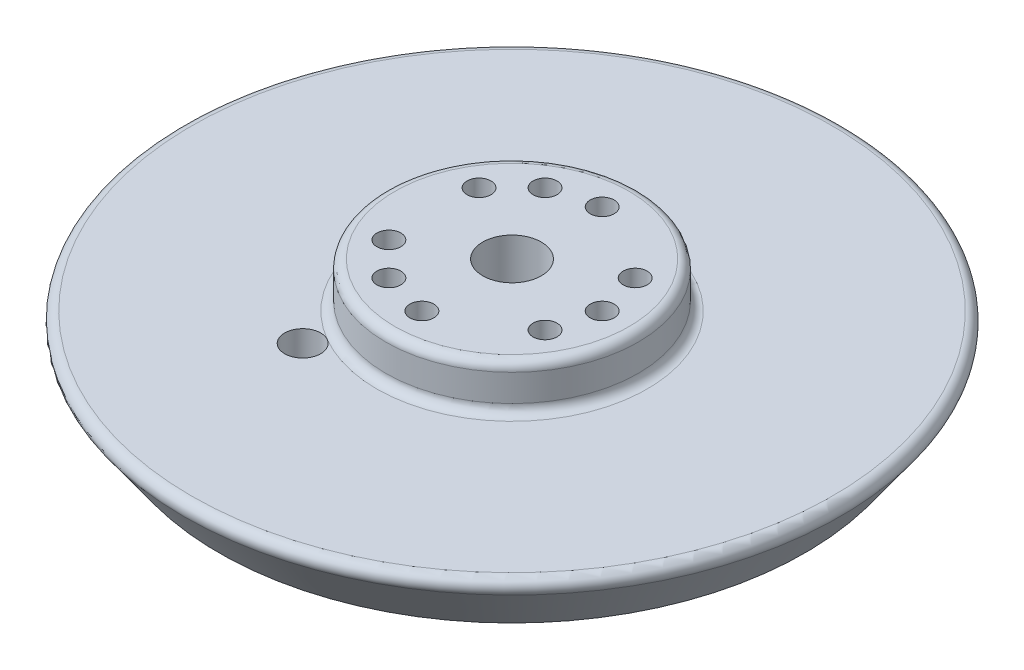
ISO-10303-21;
HEADER;
FILE_DESCRIPTION(('STEP AP214'),'2;1');
FILE_NAME('part.step','',(''),(''),'','','');
FILE_SCHEMA(('AUTOMOTIVE_DESIGN { 1 0 10303 214 1 1 1 1 }'));
ENDSEC;
DATA;
#1=APPLICATION_CONTEXT('core data for automotive mechanical design processes');
#2=APPLICATION_PROTOCOL_DEFINITION('international standard','automotive_design',2000,#1);
#3=PRODUCT_CONTEXT('',#1,'mechanical');
#4=PRODUCT('Part','Part','',(#3));
#5=PRODUCT_RELATED_PRODUCT_CATEGORY('part','',(#4));
#6=PRODUCT_DEFINITION_FORMATION('','',#4);
#7=PRODUCT_DEFINITION_CONTEXT('part definition',#1,'design');
#8=PRODUCT_DEFINITION('design','',#6,#7);
#9=PRODUCT_DEFINITION_SHAPE('','',#8);
#10=(LENGTH_UNIT() NAMED_UNIT(*) SI_UNIT(.MILLI.,.METRE.));
#11=(NAMED_UNIT(*) PLANE_ANGLE_UNIT() SI_UNIT($,.RADIAN.));
#12=(NAMED_UNIT(*) SI_UNIT($,.STERADIAN.) SOLID_ANGLE_UNIT());
#13=UNCERTAINTY_MEASURE_WITH_UNIT(LENGTH_MEASURE(1.E-05),#10,'distance_accuracy_value','');
#14=(GEOMETRIC_REPRESENTATION_CONTEXT(3) GLOBAL_UNCERTAINTY_ASSIGNED_CONTEXT((#13)) GLOBAL_UNIT_ASSIGNED_CONTEXT((#10,
#11,#12)) REPRESENTATION_CONTEXT('',''));
#15=CARTESIAN_POINT('',(0.,0.,0.));
#16=DIRECTION('',(0.,0.,1.));
#17=DIRECTION('',(1.,0.,0.));
#18=AXIS2_PLACEMENT_3D('',#15,#16,#17);
#19=CARTESIAN_POINT('',(0.,0.,0.));
#20=DIRECTION('',(0.,1.,0.));
#21=DIRECTION('',(0.,0.,1.));
#22=AXIS2_PLACEMENT_3D('',#19,#20,#21);
#23=PLANE('',#22);
#24=CARTESIAN_POINT('',(1.0842021724855E-13,0.,-10.));
#25=DIRECTION('',(0.,1.,0.));
#26=DIRECTION('',(0.,0.,-1.));
#27=AXIS2_PLACEMENT_3D('',#24,#25,#26);
#28=CIRCLE('',#27,1.33);
#29=CARTESIAN_POINT('',(1.0842021724855E-13,0.,-11.33));
#30=VERTEX_POINT('',#29);
#31=EDGE_CURVE('E342',#30,#30,#28,.T.);
#32=ORIENTED_EDGE('',*,*,#31,.F.);
#33=EDGE_LOOP('',(#32));
#34=FACE_BOUND('',#33,.T.);
#35=CARTESIAN_POINT('',(-8.66025403784435,0.,-5.00000000000007));
#36=DIRECTION('',(0.,1.,0.));
#37=DIRECTION('',(0.,0.,1.));
#38=AXIS2_PLACEMENT_3D('',#35,#36,#37);
#39=CIRCLE('',#38,1.33);
#40=CARTESIAN_POINT('',(-8.66025403784435,0.,-3.67000000000007));
#41=VERTEX_POINT('',#40);
#42=EDGE_CURVE('E341',#41,#41,#39,.T.);
#43=ORIENTED_EDGE('',*,*,#42,.F.);
#44=EDGE_LOOP('',(#43));
#45=FACE_BOUND('',#44,.T.);
#46=CARTESIAN_POINT('',(-8.66025403784442,0.,4.99999999999995));
#47=DIRECTION('',(0.,1.,0.));
#48=DIRECTION('',(0.,0.,-1.));
#49=AXIS2_PLACEMENT_3D('',#46,#47,#48);
#50=CIRCLE('',#49,1.33);
#51=CARTESIAN_POINT('',(-8.66025403784442,0.,3.66999999999995));
#52=VERTEX_POINT('',#51);
#53=EDGE_CURVE('E407',#52,#52,#50,.T.);
#54=ORIENTED_EDGE('',*,*,#53,.F.);
#55=EDGE_LOOP('',(#54));
#56=FACE_BOUND('',#55,.T.);
#57=CARTESIAN_POINT('',(0.,0.,10.));
#58=DIRECTION('',(0.,1.,0.));
#59=DIRECTION('',(0.,0.,1.));
#60=AXIS2_PLACEMENT_3D('',#57,#58,#59);
#61=CIRCLE('',#60,1.33);
#62=CARTESIAN_POINT('',(0.,0.,11.33));
#63=VERTEX_POINT('',#62);
#64=EDGE_CURVE('E401',#63,#63,#61,.T.);
#65=ORIENTED_EDGE('',*,*,#64,.F.);
#66=EDGE_LOOP('',(#65));
#67=FACE_BOUND('',#66,.T.);
#68=CARTESIAN_POINT('',(8.66025403784438,0.,5.00000000000001));
#69=DIRECTION('',(0.,1.,0.));
#70=DIRECTION('',(0.,0.,-1.));
#71=AXIS2_PLACEMENT_3D('',#68,#69,#70);
#72=CIRCLE('',#71,1.33);
#73=CARTESIAN_POINT('',(8.66025403784438,0.,3.67000000000001));
#74=VERTEX_POINT('',#73);
#75=EDGE_CURVE('E394',#74,#74,#72,.T.);
#76=ORIENTED_EDGE('',*,*,#75,.F.);
#77=EDGE_LOOP('',(#76));
#78=FACE_BOUND('',#77,.T.);
#79=CARTESIAN_POINT('',(8.66025403784438,0.,-5.00000000000001));
#80=DIRECTION('',(0.,1.,0.));
#81=DIRECTION('',(0.,0.,1.));
#82=AXIS2_PLACEMENT_3D('',#79,#80,#81);
#83=CIRCLE('',#82,1.33);
#84=CARTESIAN_POINT('',(8.66025403784438,0.,-3.67000000000001));
#85=VERTEX_POINT('',#84);
#86=EDGE_CURVE('E59',#85,#85,#83,.T.);
#87=ORIENTED_EDGE('',*,*,#86,.F.);
#88=EDGE_LOOP('',(#87));
#89=FACE_BOUND('',#88,.T.);
#90=CARTESIAN_POINT('',(-4.99999999999992,0.,8.66025403784443));
#91=DIRECTION('',(0.,1.,0.));
#92=DIRECTION('',(0.,0.,1.));
#93=AXIS2_PLACEMENT_3D('',#90,#91,#92);
#94=CIRCLE('',#93,1.33);
#95=CARTESIAN_POINT('',(-4.99999999999992,0.,9.99025403784443));
#96=VERTEX_POINT('',#95);
#97=EDGE_CURVE('E56',#96,#96,#94,.F.);
#98=ORIENTED_EDGE('',*,*,#97,.T.);
#99=EDGE_LOOP('',(#98));
#100=FACE_BOUND('',#99,.T.);
#101=CARTESIAN_POINT('',(-5.00000000000004,0.,-8.66025403784437));
#102=DIRECTION('',(0.,1.,0.));
#103=DIRECTION('',(0.,0.,1.));
#104=AXIS2_PLACEMENT_3D('',#101,#102,#103);
#105=CIRCLE('',#104,1.33);
#106=CARTESIAN_POINT('',(-5.00000000000004,0.,-7.33025403784437));
#107=VERTEX_POINT('',#106);
#108=EDGE_CURVE('E362',#107,#107,#105,.F.);
#109=ORIENTED_EDGE('',*,*,#108,.T.);
#110=EDGE_LOOP('',(#109));
#111=FACE_BOUND('',#110,.T.);
#112=CARTESIAN_POINT('',(10.,0.,0.));
#113=DIRECTION('',(0.,1.,0.));
#114=DIRECTION('',(0.,0.,1.));
#115=AXIS2_PLACEMENT_3D('',#112,#113,#114);
#116=CIRCLE('',#115,1.33);
#117=CARTESIAN_POINT('',(10.,0.,1.33));
#118=VERTEX_POINT('',#117);
#119=EDGE_CURVE('E356',#118,#118,#116,.F.);
#120=ORIENTED_EDGE('',*,*,#119,.T.);
#121=EDGE_LOOP('',(#120));
#122=FACE_BOUND('',#121,.T.);
#123=CARTESIAN_POINT('',(0.,0.,0.));
#124=DIRECTION('',(0.,1.,0.));
#125=DIRECTION('',(0.,0.,1.));
#126=AXIS2_PLACEMENT_3D('',#123,#124,#125);
#127=CIRCLE('',#126,3.25);
#128=CARTESIAN_POINT('',(0.,0.,3.25));
#129=VERTEX_POINT('',#128);
#130=EDGE_CURVE('E63',#129,#129,#127,.F.);
#131=ORIENTED_EDGE('',*,*,#130,.T.);
#132=EDGE_LOOP('',(#131));
#133=FACE_BOUND('',#132,.T.);
#134=CARTESIAN_POINT('',(0.,0.,0.));
#135=DIRECTION('',(0.,1.,0.));
#136=DIRECTION('',(0.,0.,1.));
#137=AXIS2_PLACEMENT_3D('',#134,#135,#136);
#138=CIRCLE('',#137,13.);
#139=CARTESIAN_POINT('',(0.,0.,13.));
#140=VERTEX_POINT('',#139);
#141=EDGE_CURVE('E76',#140,#140,#138,.T.);
#142=ORIENTED_EDGE('',*,*,#141,.T.);
#143=EDGE_LOOP('',(#142));
#144=FACE_BOUND('',#143,.T.);
#145=ADVANCED_FACE('F35',(#34,#45,#56,#67,#78,#89,#100,#111,#122,#133,#144),#23,.T.);
#146=CARTESIAN_POINT('',(0.,0.,0.));
#147=DIRECTION('',(0.,-1.,0.));
#148=DIRECTION('',(0.,0.,-1.));
#149=AXIS2_PLACEMENT_3D('',#146,#147,#148);
#150=CYLINDRICAL_SURFACE('',#149,14.);
#151=CARTESIAN_POINT('',(0.,-1.,0.));
#152=DIRECTION('',(0.,1.,0.));
#153=DIRECTION('',(0.,0.,1.));
#154=AXIS2_PLACEMENT_3D('',#151,#152,#153);
#155=CIRCLE('',#154,14.);
#156=CARTESIAN_POINT('',(0.,-1.,14.));
#157=VERTEX_POINT('',#156);
#158=EDGE_CURVE('E73',#157,#157,#155,.F.);
#159=ORIENTED_EDGE('',*,*,#158,.T.);
#160=EDGE_LOOP('',(#159));
#161=FACE_BOUND('',#160,.T.);
#162=CARTESIAN_POINT('',(0.,-4.,0.));
#163=DIRECTION('',(0.,1.,0.));
#164=DIRECTION('',(0.,0.,1.));
#165=AXIS2_PLACEMENT_3D('',#162,#163,#164);
#166=CIRCLE('',#165,14.);
#167=CARTESIAN_POINT('',(0.,-4.,14.));
#168=VERTEX_POINT('',#167);
#169=EDGE_CURVE('E70',#168,#168,#166,.T.);
#170=ORIENTED_EDGE('',*,*,#169,.T.);
#171=EDGE_LOOP('',(#170));
#172=FACE_BOUND('',#171,.T.);
#173=ADVANCED_FACE('F106',(#161,#172),#150,.T.);
#174=CARTESIAN_POINT('',(14.,-5.,0.));
#175=DIRECTION('',(0.,1.,0.));
#176=DIRECTION('',(0.,0.,1.));
#177=AXIS2_PLACEMENT_3D('',#174,#175,#176);
#178=PLANE('',#177);
#179=CARTESIAN_POINT('',(0.,-5.,0.));
#180=DIRECTION('',(0.,1.,0.));
#181=DIRECTION('',(0.,0.,1.));
#182=AXIS2_PLACEMENT_3D('',#179,#180,#181);
#183=CIRCLE('',#182,15.);
#184=CARTESIAN_POINT('',(-7.5,-5.,12.9903810567666));
#185=VERTEX_POINT('',#184);
#186=EDGE_CURVE('E82',#185,#185,#183,.F.);
#187=ORIENTED_EDGE('',*,*,#186,.T.);
#188=CARTESIAN_POINT('',(-8.5,-5.,14.7224318643355));
#189=DIRECTION('',(0.,1.,0.));
#190=DIRECTION('',(0.,0.,1.));
#191=AXIS2_PLACEMENT_3D('',#188,#189,#190);
#192=CIRCLE('',#191,2.);
#193=EDGE_CURVE('E47',#185,#185,#192,.F.);
#194=ORIENTED_EDGE('',*,*,#193,.T.);
#195=EDGE_LOOP('',(#187,#194));
#196=FACE_BOUND('',#195,.T.);
#197=CARTESIAN_POINT('',(0.,-5.,0.));
#198=DIRECTION('',(0.,1.,0.));
#199=DIRECTION('',(0.,0.,1.));
#200=AXIS2_PLACEMENT_3D('',#197,#198,#199);
#201=CIRCLE('',#200,35.5568106761368);
#202=CARTESIAN_POINT('',(0.,-5.,35.5568106761368));
#203=VERTEX_POINT('',#202);
#204=EDGE_CURVE('E79',#203,#203,#201,.T.);
#205=ORIENTED_EDGE('',*,*,#204,.T.);
#206=EDGE_LOOP('',(#205));
#207=FACE_BOUND('',#206,.T.);
#208=ADVANCED_FACE('F112',(#196,#207),#178,.T.);
#209=CARTESIAN_POINT('',(0.,-12.,0.));
#210=DIRECTION('',(0.,1.,0.));
#211=DIRECTION('',(0.,0.,1.));
#212=AXIS2_PLACEMENT_3D('',#209,#210,#211);
#213=CONICAL_SURFACE('',#212,32.5,0.620249485982821);
#214=CARTESIAN_POINT('',(0.,-6.58123819371909,0.));
#215=DIRECTION('',(0.,-1.,0.));
#216=DIRECTION('',(0.,0.,-1.));
#217=AXIS2_PLACEMENT_3D('',#214,#215,#216);
#218=CIRCLE('',#217,36.3705441473435);
#219=CARTESIAN_POINT('',(0.,-6.58123819371909,-36.3705441473435));
#220=VERTEX_POINT('',#219);
#221=EDGE_CURVE('E84',#220,#220,#218,.T.);
#222=ORIENTED_EDGE('',*,*,#221,.T.);
#223=EDGE_LOOP('',(#222));
#224=FACE_BOUND('',#223,.T.);
#225=CARTESIAN_POINT('',(0.,-12.,0.));
#226=DIRECTION('',(0.,-1.,0.));
#227=DIRECTION('',(0.,0.,-1.));
#228=AXIS2_PLACEMENT_3D('',#225,#226,#227);
#229=CIRCLE('',#228,32.5);
#230=CARTESIAN_POINT('',(0.,-12.,-32.5));
#231=VERTEX_POINT('',#230);
#232=EDGE_CURVE('E66',#231,#231,#229,.T.);
#233=ORIENTED_EDGE('',*,*,#232,.F.);
#234=EDGE_LOOP('',(#233));
#235=FACE_BOUND('',#234,.T.);
#236=ADVANCED_FACE('F139',(#224,#235),#213,.T.);
#237=CARTESIAN_POINT('',(32.5,-12.,0.));
#238=DIRECTION('',(0.,-1.,0.));
#239=DIRECTION('',(0.,0.,-1.));
#240=AXIS2_PLACEMENT_3D('',#237,#238,#239);
#241=PLANE('',#240);
#242=CARTESIAN_POINT('',(0.,-12.,0.));
#243=DIRECTION('',(0.,-1.,0.));
#244=DIRECTION('',(0.,0.,-1.));
#245=AXIS2_PLACEMENT_3D('',#242,#243,#244);
#246=CIRCLE('',#245,5.25000000000002);
#247=CARTESIAN_POINT('',(0.,-12.,-5.25000000000002));
#248=VERTEX_POINT('',#247);
#249=EDGE_CURVE('E11',#248,#248,#246,.F.);
#250=ORIENTED_EDGE('',*,*,#249,.T.);
#251=EDGE_LOOP('',(#250));
#252=FACE_BOUND('',#251,.T.);
#253=CARTESIAN_POINT('',(-8.5,-12.,14.7224318643355));
#254=DIRECTION('',(0.,-1.,0.));
#255=DIRECTION('',(0.,0.,-1.));
#256=AXIS2_PLACEMENT_3D('',#253,#254,#255);
#257=CIRCLE('',#256,2.);
#258=CARTESIAN_POINT('',(-8.5,-12.,12.7224318643355));
#259=VERTEX_POINT('',#258);
#260=EDGE_CURVE('E52',#259,#259,#257,.T.);
#261=ORIENTED_EDGE('',*,*,#260,.F.);
#262=EDGE_LOOP('',(#261));
#263=FACE_BOUND('',#262,.T.);
#264=CARTESIAN_POINT('',(-4.99999999999992,-12.,8.66025403784443));
#265=DIRECTION('',(0.,-1.,0.));
#266=DIRECTION('',(0.,0.,-1.));
#267=AXIS2_PLACEMENT_3D('',#264,#265,#266);
#268=CIRCLE('',#267,1.33);
#269=CARTESIAN_POINT('',(-4.99999999999992,-12.,7.33025403784443));
#270=VERTEX_POINT('',#269);
#271=EDGE_CURVE('E365',#270,#270,#268,.T.);
#272=ORIENTED_EDGE('',*,*,#271,.F.);
#273=EDGE_LOOP('',(#272));
#274=FACE_BOUND('',#273,.T.);
#275=CARTESIAN_POINT('',(-5.00000000000004,-12.,-8.66025403784437));
#276=DIRECTION('',(0.,-1.,0.));
#277=DIRECTION('',(0.,0.,-1.));
#278=AXIS2_PLACEMENT_3D('',#275,#276,#277);
#279=CIRCLE('',#278,1.33);
#280=CARTESIAN_POINT('',(-5.00000000000004,-12.,-9.99025403784437));
#281=VERTEX_POINT('',#280);
#282=EDGE_CURVE('E359',#281,#281,#279,.T.);
#283=ORIENTED_EDGE('',*,*,#282,.F.);
#284=EDGE_LOOP('',(#283));
#285=FACE_BOUND('',#284,.T.);
#286=CARTESIAN_POINT('',(10.,-12.,0.));
#287=DIRECTION('',(0.,-1.,0.));
#288=DIRECTION('',(0.,0.,-1.));
#289=AXIS2_PLACEMENT_3D('',#286,#287,#288);
#290=CIRCLE('',#289,1.33);
#291=CARTESIAN_POINT('',(10.,-12.,-1.33));
#292=VERTEX_POINT('',#291);
#293=EDGE_CURVE('E67',#292,#292,#290,.T.);
#294=ORIENTED_EDGE('',*,*,#293,.F.);
#295=EDGE_LOOP('',(#294));
#296=FACE_BOUND('',#295,.T.);
#297=ORIENTED_EDGE('',*,*,#232,.T.);
#298=EDGE_LOOP('',(#297));
#299=FACE_BOUND('',#298,.T.);
#300=ADVANCED_FACE('F123',(#252,#263,#274,#285,#296,#299),#241,.T.);
#301=CARTESIAN_POINT('',(0.,-1.,0.));
#302=DIRECTION('',(0.,1.,0.));
#303=DIRECTION('',(0.,0.,1.));
#304=AXIS2_PLACEMENT_3D('',#301,#302,#303);
#305=TOROIDAL_SURFACE('',#304,13.,1.);
#306=ORIENTED_EDGE('',*,*,#141,.F.);
#307=EDGE_LOOP('',(#306));
#308=FACE_BOUND('',#307,.T.);
#309=ORIENTED_EDGE('',*,*,#158,.F.);
#310=EDGE_LOOP('',(#309));
#311=FACE_BOUND('',#310,.T.);
#312=ADVANCED_FACE('F119',(#308,#311),#305,.T.);
#313=CARTESIAN_POINT('',(0.,-4.,0.));
#314=DIRECTION('',(0.,1.,0.));
#315=DIRECTION('',(0.,0.,1.));
#316=AXIS2_PLACEMENT_3D('',#313,#314,#315);
#317=TOROIDAL_SURFACE('',#316,15.,1.);
#318=ORIENTED_EDGE('',*,*,#169,.F.);
#319=EDGE_LOOP('',(#318));
#320=FACE_BOUND('',#319,.T.);
#321=ORIENTED_EDGE('',*,*,#186,.F.);
#322=EDGE_LOOP('',(#321));
#323=FACE_BOUND('',#322,.T.);
#324=ADVANCED_FACE('F122',(#320,#323),#317,.F.);
#325=CARTESIAN_POINT('',(0.,-6.,0.));
#326=DIRECTION('',(0.,1.,0.));
#327=DIRECTION('',(0.,0.,1.));
#328=AXIS2_PLACEMENT_3D('',#325,#326,#327);
#329=TOROIDAL_SURFACE('',#328,35.5568106761368,1.);
#330=ORIENTED_EDGE('',*,*,#204,.F.);
#331=EDGE_LOOP('',(#330));
#332=FACE_BOUND('',#331,.T.);
#333=ORIENTED_EDGE('',*,*,#221,.F.);
#334=EDGE_LOOP('',(#333));
#335=FACE_BOUND('',#334,.T.);
#336=ADVANCED_FACE('F126',(#332,#335),#329,.T.);
#337=CARTESIAN_POINT('',(0.,0.000999999999999265,0.));
#338=DIRECTION('',(0.,-1.,0.));
#339=DIRECTION('',(0.,0.,-1.));
#340=AXIS2_PLACEMENT_3D('',#337,#338,#339);
#341=CYLINDRICAL_SURFACE('',#340,3.25);
#342=CARTESIAN_POINT('',(0.,-9.99999999999999,0.));
#343=DIRECTION('',(0.,-1.,0.));
#344=DIRECTION('',(0.,0.,-1.));
#345=AXIS2_PLACEMENT_3D('',#342,#343,#344);
#346=CIRCLE('',#345,3.25);
#347=CARTESIAN_POINT('',(0.,-9.99999999999999,-3.25));
#348=VERTEX_POINT('',#347);
#349=EDGE_CURVE('E43',#348,#348,#346,.T.);
#350=ORIENTED_EDGE('',*,*,#349,.T.);
#351=EDGE_LOOP('',(#350));
#352=FACE_BOUND('',#351,.T.);
#353=ORIENTED_EDGE('',*,*,#130,.F.);
#354=EDGE_LOOP('',(#353));
#355=FACE_BOUND('',#354,.T.);
#356=ADVANCED_FACE('F89',(#352,#355),#341,.F.);
#357=CARTESIAN_POINT('',(10.,0.000999999999999265,0.));
#358=DIRECTION('',(0.,-1.,0.));
#359=DIRECTION('',(0.,0.,-1.));
#360=AXIS2_PLACEMENT_3D('',#357,#358,#359);
#361=CYLINDRICAL_SURFACE('',#360,1.33);
#362=ORIENTED_EDGE('',*,*,#119,.F.);
#363=EDGE_LOOP('',(#362));
#364=FACE_BOUND('',#363,.T.);
#365=ORIENTED_EDGE('',*,*,#293,.T.);
#366=EDGE_LOOP('',(#365));
#367=FACE_BOUND('',#366,.T.);
#368=ADVANCED_FACE('F133',(#364,#367),#361,.F.);
#369=CARTESIAN_POINT('',(-5.00000000000004,0.000999999999999265,-8.66025403784437));
#370=DIRECTION('',(0.,-1.,0.));
#371=DIRECTION('',(0.,0.,-1.));
#372=AXIS2_PLACEMENT_3D('',#369,#370,#371);
#373=CYLINDRICAL_SURFACE('',#372,1.33);
#374=ORIENTED_EDGE('',*,*,#108,.F.);
#375=EDGE_LOOP('',(#374));
#376=FACE_BOUND('',#375,.T.);
#377=ORIENTED_EDGE('',*,*,#282,.T.);
#378=EDGE_LOOP('',(#377));
#379=FACE_BOUND('',#378,.T.);
#380=ADVANCED_FACE('F195',(#376,#379),#373,.F.);
#381=CARTESIAN_POINT('',(-4.99999999999992,0.000999999999999265,8.66025403784443));
#382=DIRECTION('',(0.,-1.,0.));
#383=DIRECTION('',(0.,0.,-1.));
#384=AXIS2_PLACEMENT_3D('',#381,#382,#383);
#385=CYLINDRICAL_SURFACE('',#384,1.33);
#386=ORIENTED_EDGE('',*,*,#97,.F.);
#387=EDGE_LOOP('',(#386));
#388=FACE_BOUND('',#387,.T.);
#389=ORIENTED_EDGE('',*,*,#271,.T.);
#390=EDGE_LOOP('',(#389));
#391=FACE_BOUND('',#390,.T.);
#392=ADVANCED_FACE('F102',(#388,#391),#385,.F.);
#393=CARTESIAN_POINT('',(-8.5,0.000999999999999265,14.7224318643355));
#394=DIRECTION('',(0.,-1.,0.));
#395=DIRECTION('',(0.,0.,-1.));
#396=AXIS2_PLACEMENT_3D('',#393,#394,#395);
#397=CYLINDRICAL_SURFACE('',#396,2.);
#398=ORIENTED_EDGE('',*,*,#193,.F.);
#399=EDGE_LOOP('',(#398));
#400=FACE_BOUND('',#399,.T.);
#401=ORIENTED_EDGE('',*,*,#260,.T.);
#402=EDGE_LOOP('',(#401));
#403=FACE_BOUND('',#402,.T.);
#404=ADVANCED_FACE('F48',(#400,#403),#397,.F.);
#405=CARTESIAN_POINT('',(0.,-9.99999999999999,0.));
#406=DIRECTION('',(0.,-1.,0.));
#407=DIRECTION('',(0.,0.,-1.));
#408=AXIS2_PLACEMENT_3D('',#405,#406,#407);
#409=CONICAL_SURFACE('',#408,3.25,0.785398163397449);
#410=ORIENTED_EDGE('',*,*,#249,.F.);
#411=EDGE_LOOP('',(#410));
#412=FACE_BOUND('',#411,.T.);
#413=ORIENTED_EDGE('',*,*,#349,.F.);
#414=EDGE_LOOP('',(#413));
#415=FACE_BOUND('',#414,.T.);
#416=ADVANCED_FACE('F38',(#412,#415),#409,.F.);
#417=CARTESIAN_POINT('',(8.66025403784438,-8.76180807591243,-5.00000000000001));
#418=DIRECTION('',(0.,1.,0.));
#419=DIRECTION('',(0.,0.,1.));
#420=AXIS2_PLACEMENT_3D('',#417,#418,#419);
#421=CYLINDRICAL_SURFACE('',#420,1.33);
#422=CARTESIAN_POINT('',(8.66025403784438,-5.,-5.00000000000001));
#423=DIRECTION('',(0.,1.,0.));
#424=DIRECTION('',(0.,0.,1.));
#425=AXIS2_PLACEMENT_3D('',#422,#423,#424);
#426=CIRCLE('',#425,1.33);
#427=CARTESIAN_POINT('',(8.66025403784438,-5.,-3.67000000000001));
#428=VERTEX_POINT('',#427);
#429=EDGE_CURVE('E53',#428,#428,#426,.F.);
#430=ORIENTED_EDGE('',*,*,#429,.T.);
#431=EDGE_LOOP('',(#430));
#432=FACE_BOUND('',#431,.T.);
#433=ORIENTED_EDGE('',*,*,#86,.T.);
#434=EDGE_LOOP('',(#433));
#435=FACE_BOUND('',#434,.T.);
#436=ADVANCED_FACE('F93',(#432,#435),#421,.F.);
#437=CARTESIAN_POINT('',(14.,-5.,0.));
#438=DIRECTION('',(0.,1.,0.));
#439=DIRECTION('',(0.,0.,1.));
#440=AXIS2_PLACEMENT_3D('',#437,#438,#439);
#441=PLANE('',#440);
#442=ORIENTED_EDGE('',*,*,#429,.F.);
#443=EDGE_LOOP('',(#442));
#444=FACE_BOUND('',#443,.T.);
#445=ADVANCED_FACE('F99',(#444),#441,.T.);
#446=CARTESIAN_POINT('',(8.66025403784438,-8.76180807591243,5.00000000000001));
#447=DIRECTION('',(0.,1.,0.));
#448=DIRECTION('',(0.,0.,1.));
#449=AXIS2_PLACEMENT_3D('',#446,#447,#448);
#450=CYLINDRICAL_SURFACE('',#449,1.33);
#451=CARTESIAN_POINT('',(8.66025403784438,-5.,5.00000000000001));
#452=DIRECTION('',(0.,1.,0.));
#453=DIRECTION('',(0.,0.,1.));
#454=AXIS2_PLACEMENT_3D('',#451,#452,#453);
#455=CIRCLE('',#454,1.33);
#456=CARTESIAN_POINT('',(8.66025403784438,-5.,6.33000000000001));
#457=VERTEX_POINT('',#456);
#458=EDGE_CURVE('E352',#457,#457,#455,.F.);
#459=ORIENTED_EDGE('',*,*,#458,.T.);
#460=EDGE_LOOP('',(#459));
#461=FACE_BOUND('',#460,.T.);
#462=ORIENTED_EDGE('',*,*,#75,.T.);
#463=EDGE_LOOP('',(#462));
#464=FACE_BOUND('',#463,.T.);
#465=ADVANCED_FACE('F234',(#461,#464),#450,.F.);
#466=CARTESIAN_POINT('',(14.,-5.,0.));
#467=DIRECTION('',(0.,1.,0.));
#468=DIRECTION('',(0.,0.,1.));
#469=AXIS2_PLACEMENT_3D('',#466,#467,#468);
#470=PLANE('',#469);
#471=ORIENTED_EDGE('',*,*,#458,.F.);
#472=EDGE_LOOP('',(#471));
#473=FACE_BOUND('',#472,.T.);
#474=ADVANCED_FACE('F243',(#473),#470,.T.);
#475=CARTESIAN_POINT('',(0.,-8.76180807591243,10.));
#476=DIRECTION('',(0.,1.,0.));
#477=DIRECTION('',(0.,0.,1.));
#478=AXIS2_PLACEMENT_3D('',#475,#476,#477);
#479=CYLINDRICAL_SURFACE('',#478,1.33);
#480=CARTESIAN_POINT('',(0.,-5.,10.));
#481=DIRECTION('',(0.,1.,0.));
#482=DIRECTION('',(0.,0.,1.));
#483=AXIS2_PLACEMENT_3D('',#480,#481,#482);
#484=CIRCLE('',#483,1.33);
#485=CARTESIAN_POINT('',(0.,-5.,11.33));
#486=VERTEX_POINT('',#485);
#487=EDGE_CURVE('E398',#486,#486,#484,.F.);
#488=ORIENTED_EDGE('',*,*,#487,.T.);
#489=EDGE_LOOP('',(#488));
#490=FACE_BOUND('',#489,.T.);
#491=ORIENTED_EDGE('',*,*,#64,.T.);
#492=EDGE_LOOP('',(#491));
#493=FACE_BOUND('',#492,.T.);
#494=ADVANCED_FACE('F252',(#490,#493),#479,.F.);
#495=CARTESIAN_POINT('',(14.,-5.,0.));
#496=DIRECTION('',(0.,1.,0.));
#497=DIRECTION('',(0.,0.,1.));
#498=AXIS2_PLACEMENT_3D('',#495,#496,#497);
#499=PLANE('',#498);
#500=ORIENTED_EDGE('',*,*,#487,.F.);
#501=EDGE_LOOP('',(#500));
#502=FACE_BOUND('',#501,.T.);
#503=ADVANCED_FACE('F261',(#502),#499,.T.);
#504=CARTESIAN_POINT('',(-8.66025403784442,-8.76180807591243,4.99999999999995));
#505=DIRECTION('',(0.,1.,0.));
#506=DIRECTION('',(0.,0.,1.));
#507=AXIS2_PLACEMENT_3D('',#504,#505,#506);
#508=CYLINDRICAL_SURFACE('',#507,1.33);
#509=CARTESIAN_POINT('',(-8.66025403784442,-5.,4.99999999999995));
#510=DIRECTION('',(0.,1.,0.));
#511=DIRECTION('',(0.,0.,1.));
#512=AXIS2_PLACEMENT_3D('',#509,#510,#511);
#513=CIRCLE('',#512,1.33);
#514=CARTESIAN_POINT('',(-8.66025403784442,-5.,6.32999999999995));
#515=VERTEX_POINT('',#514);
#516=EDGE_CURVE('E404',#515,#515,#513,.F.);
#517=ORIENTED_EDGE('',*,*,#516,.T.);
#518=EDGE_LOOP('',(#517));
#519=FACE_BOUND('',#518,.T.);
#520=ORIENTED_EDGE('',*,*,#53,.T.);
#521=EDGE_LOOP('',(#520));
#522=FACE_BOUND('',#521,.T.);
#523=ADVANCED_FACE('F270',(#519,#522),#508,.F.);
#524=CARTESIAN_POINT('',(14.,-5.,0.));
#525=DIRECTION('',(0.,1.,0.));
#526=DIRECTION('',(0.,0.,1.));
#527=AXIS2_PLACEMENT_3D('',#524,#525,#526);
#528=PLANE('',#527);
#529=ORIENTED_EDGE('',*,*,#516,.F.);
#530=EDGE_LOOP('',(#529));
#531=FACE_BOUND('',#530,.T.);
#532=ADVANCED_FACE('F279',(#531),#528,.T.);
#533=CARTESIAN_POINT('',(-8.66025403784435,-8.76180807591243,-5.00000000000007));
#534=DIRECTION('',(0.,1.,0.));
#535=DIRECTION('',(0.,0.,1.));
#536=AXIS2_PLACEMENT_3D('',#533,#534,#535);
#537=CYLINDRICAL_SURFACE('',#536,1.33);
#538=CARTESIAN_POINT('',(-8.66025403784435,-5.,-5.00000000000007));
#539=DIRECTION('',(0.,1.,0.));
#540=DIRECTION('',(0.,0.,1.));
#541=AXIS2_PLACEMENT_3D('',#538,#539,#540);
#542=CIRCLE('',#541,1.33);
#543=CARTESIAN_POINT('',(-8.66025403784435,-5.,-3.67000000000007));
#544=VERTEX_POINT('',#543);
#545=EDGE_CURVE('E345',#544,#544,#542,.F.);
#546=ORIENTED_EDGE('',*,*,#545,.T.);
#547=EDGE_LOOP('',(#546));
#548=FACE_BOUND('',#547,.T.);
#549=ORIENTED_EDGE('',*,*,#42,.T.);
#550=EDGE_LOOP('',(#549));
#551=FACE_BOUND('',#550,.T.);
#552=ADVANCED_FACE('F288',(#548,#551),#537,.F.);
#553=CARTESIAN_POINT('',(14.,-5.,0.));
#554=DIRECTION('',(0.,1.,0.));
#555=DIRECTION('',(0.,0.,1.));
#556=AXIS2_PLACEMENT_3D('',#553,#554,#555);
#557=PLANE('',#556);
#558=ORIENTED_EDGE('',*,*,#545,.F.);
#559=EDGE_LOOP('',(#558));
#560=FACE_BOUND('',#559,.T.);
#561=ADVANCED_FACE('F297',(#560),#557,.T.);
#562=CARTESIAN_POINT('',(1.0842021724855E-13,-8.76180807591243,-10.));
#563=DIRECTION('',(0.,1.,0.));
#564=DIRECTION('',(0.,0.,1.));
#565=AXIS2_PLACEMENT_3D('',#562,#563,#564);
#566=CYLINDRICAL_SURFACE('',#565,1.33);
#567=CARTESIAN_POINT('',(1.0842021724855E-13,-5.,-10.));
#568=DIRECTION('',(0.,1.,0.));
#569=DIRECTION('',(0.,0.,1.));
#570=AXIS2_PLACEMENT_3D('',#567,#568,#569);
#571=CIRCLE('',#570,1.33);
#572=CARTESIAN_POINT('',(1.0842021724855E-13,-5.,-8.67));
#573=VERTEX_POINT('',#572);
#574=EDGE_CURVE('E340',#573,#573,#571,.F.);
#575=ORIENTED_EDGE('',*,*,#574,.T.);
#576=EDGE_LOOP('',(#575));
#577=FACE_BOUND('',#576,.T.);
#578=ORIENTED_EDGE('',*,*,#31,.T.);
#579=EDGE_LOOP('',(#578));
#580=FACE_BOUND('',#579,.T.);
#581=ADVANCED_FACE('F306',(#577,#580),#566,.F.);
#582=CARTESIAN_POINT('',(14.,-5.,0.));
#583=DIRECTION('',(0.,1.,0.));
#584=DIRECTION('',(0.,0.,1.));
#585=AXIS2_PLACEMENT_3D('',#582,#583,#584);
#586=PLANE('',#585);
#587=ORIENTED_EDGE('',*,*,#574,.F.);
#588=EDGE_LOOP('',(#587));
#589=FACE_BOUND('',#588,.T.);
#590=ADVANCED_FACE('F315',(#589),#586,.T.);
#591=CLOSED_SHELL('',(#145,#173,#208,#236,#300,#312,#324,#336,#356,#368,#380,#392,#404,#416,
#436,#445,#465,#474,#494,#503,#523,#532,#552,#561,#581,#590));
#592=MANIFOLD_SOLID_BREP('B2',#591);
#593=ADVANCED_BREP_SHAPE_REPRESENTATION('',(#18,#592),#14);
#594=SHAPE_DEFINITION_REPRESENTATION(#9,#593);
ENDSEC;
END-ISO-10303-21;
